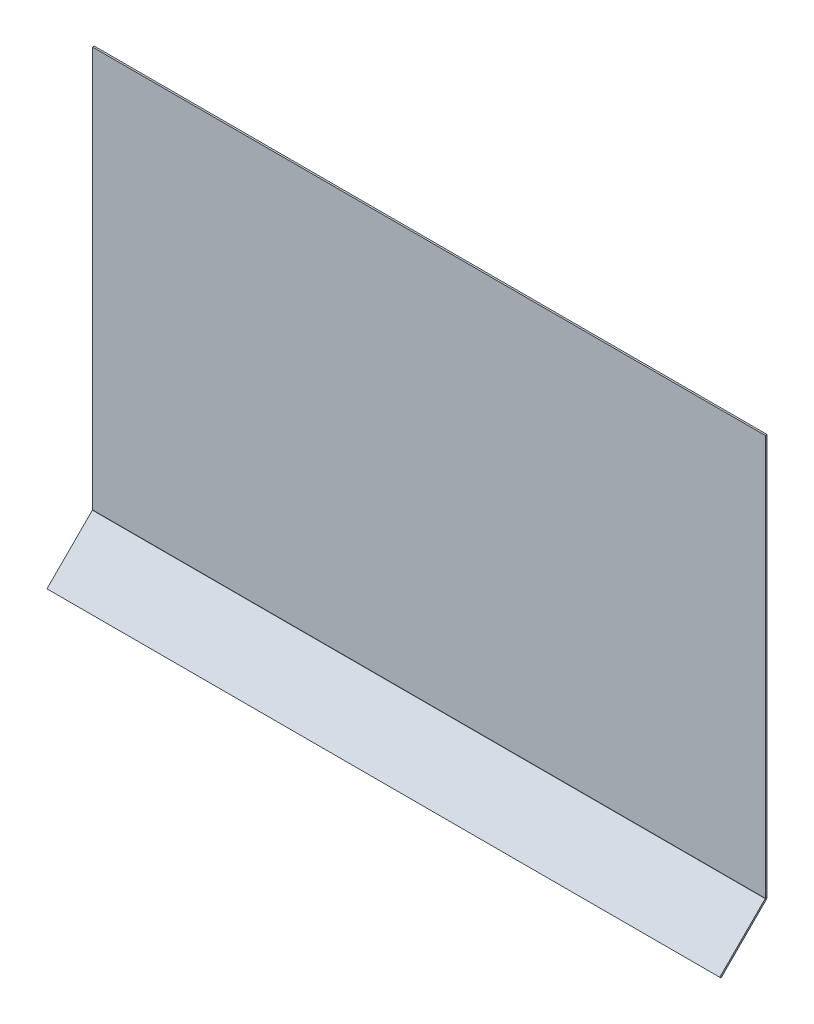
ISO-10303-21;
HEADER;
FILE_DESCRIPTION(('STEP AP214'),'2;1');
FILE_NAME('part.step','',(''),(''),'','','');
FILE_SCHEMA(('AUTOMOTIVE_DESIGN { 1 0 10303 214 1 1 1 1 }'));
ENDSEC;
DATA;
#1=APPLICATION_CONTEXT('core data for automotive mechanical design processes');
#2=APPLICATION_PROTOCOL_DEFINITION('international standard','automotive_design',2000,#1);
#3=PRODUCT_CONTEXT('',#1,'mechanical');
#4=PRODUCT('Part','Part','',(#3));
#5=PRODUCT_RELATED_PRODUCT_CATEGORY('part','',(#4));
#6=PRODUCT_DEFINITION_FORMATION('','',#4);
#7=PRODUCT_DEFINITION_CONTEXT('part definition',#1,'design');
#8=PRODUCT_DEFINITION('design','',#6,#7);
#9=PRODUCT_DEFINITION_SHAPE('','',#8);
#10=(LENGTH_UNIT() NAMED_UNIT(*) SI_UNIT(.MILLI.,.METRE.));
#11=(NAMED_UNIT(*) PLANE_ANGLE_UNIT() SI_UNIT($,.RADIAN.));
#12=(NAMED_UNIT(*) SI_UNIT($,.STERADIAN.) SOLID_ANGLE_UNIT());
#13=UNCERTAINTY_MEASURE_WITH_UNIT(LENGTH_MEASURE(1.E-05),#10,'distance_accuracy_value','');
#14=(GEOMETRIC_REPRESENTATION_CONTEXT(3) GLOBAL_UNCERTAINTY_ASSIGNED_CONTEXT((#13)) GLOBAL_UNIT_ASSIGNED_CONTEXT((#10,
#11,#12)) REPRESENTATION_CONTEXT('',''));
#15=CARTESIAN_POINT('',(0.,0.,0.));
#16=DIRECTION('',(0.,0.,1.));
#17=DIRECTION('',(1.,0.,0.));
#18=AXIS2_PLACEMENT_3D('',#15,#16,#17);
#19=CARTESIAN_POINT('',(-575.,-363.086855640565,-687.218254069481));
#20=DIRECTION('',(0.,-0.707106781186552,0.707106781186544));
#21=DIRECTION('',(1.,0.,0.));
#22=AXIS2_PLACEMENT_3D('',#19,#20,#21);
#23=PLANE('',#22);
#24=DIRECTION('',(0.,0.707106781186544,0.707106781186552));
#25=VECTOR('',#24,1.);
#26=CARTESIAN_POINT('',(-575.,-363.086855640565,-687.218254069481));
#27=LINE('',#26,#25);
#28=CARTESIAN_POINT('',(-575.,-365.208175984124,-689.33957441304));
#29=VERTEX_POINT('',#28);
#30=CARTESIAN_POINT('',(-575.,-363.086855640565,-687.218254069481));
#31=VERTEX_POINT('',#30);
#32=EDGE_CURVE('E11',#29,#31,#27,.T.);
#33=ORIENTED_EDGE('',*,*,#32,.F.);
#34=DIRECTION('',(1.,0.,0.));
#35=VECTOR('',#34,1.);
#36=CARTESIAN_POINT('',(-1.01821961997405E-13,-365.208175984124,-689.33957441304));
#37=LINE('',#36,#35);
#38=CARTESIAN_POINT('',(575.,-365.208175984124,-689.339574413041));
#39=VERTEX_POINT('',#38);
#40=EDGE_CURVE('E114',#39,#29,#37,.F.);
#41=ORIENTED_EDGE('',*,*,#40,.F.);
#42=DIRECTION('',(0.,0.707106781186544,0.707106781186552));
#43=VECTOR('',#42,1.);
#44=CARTESIAN_POINT('',(575.,-363.086855640565,-687.218254069481));
#45=LINE('',#44,#43);
#46=CARTESIAN_POINT('',(575.,-363.086855640565,-687.218254069481));
#47=VERTEX_POINT('',#46);
#48=EDGE_CURVE('E47',#39,#47,#45,.T.);
#49=ORIENTED_EDGE('',*,*,#48,.T.);
#50=DIRECTION('',(1.,0.,0.));
#51=VECTOR('',#50,1.);
#52=CARTESIAN_POINT('',(-575.,-363.086855640565,-687.218254069481));
#53=LINE('',#52,#51);
#54=EDGE_CURVE('E163',#47,#31,#53,.F.);
#55=ORIENTED_EDGE('',*,*,#54,.T.);
#56=EDGE_LOOP('',(#33,#41,#49,#55));
#57=FACE_BOUND('',#56,.T.);
#58=ADVANCED_FACE('F37',(#57),#23,.T.);
#59=CARTESIAN_POINT('',(575.,-363.086855640565,-687.218254069481));
#60=DIRECTION('',(1.,0.,0.));
#61=DIRECTION('',(0.,0.707106781186552,-0.707106781186544));
#62=AXIS2_PLACEMENT_3D('',#59,#60,#61);
#63=PLANE('',#62);
#64=ORIENTED_EDGE('',*,*,#48,.F.);
#65=DIRECTION('',(0.,-0.707106781186552,0.707106781186544));
#66=VECTOR('',#65,1.);
#67=CARTESIAN_POINT('',(575.,-527.426430053602,-527.121320343564));
#68=LINE('',#67,#66);
#69=CARTESIAN_POINT('',(575.,-287.642175198582,-766.905575198582));
#70=VERTEX_POINT('',#69);
#71=EDGE_CURVE('E111',#70,#39,#68,.T.);
#72=ORIENTED_EDGE('',*,*,#71,.F.);
#73=DIRECTION('',(0.,0.70710678118651,0.707106781186585));
#74=VECTOR('',#73,1.);
#75=CARTESIAN_POINT('',(575.,-285.520854855022,-764.784254855023));
#76=LINE('',#75,#74);
#77=CARTESIAN_POINT('',(575.,-285.520854855022,-764.784254855023));
#78=VERTEX_POINT('',#77);
#79=EDGE_CURVE('E146',#70,#78,#76,.T.);
#80=ORIENTED_EDGE('',*,*,#79,.T.);
#81=DIRECTION('',(0.,0.707106781186552,-0.707106781186544));
#82=VECTOR('',#81,1.);
#83=CARTESIAN_POINT('',(575.,-363.086855640565,-687.218254069481));
#84=LINE('',#83,#82);
#85=EDGE_CURVE('E154',#78,#47,#84,.F.);
#86=ORIENTED_EDGE('',*,*,#85,.T.);
#87=EDGE_LOOP('',(#64,#72,#80,#86));
#88=FACE_BOUND('',#87,.T.);
#89=ADVANCED_FACE('F153',(#88),#63,.T.);
#90=CARTESIAN_POINT('',(575.,-285.,-764.263400000001));
#91=DIRECTION('',(-1.,0.,0.));
#92=DIRECTION('',(0.,0.,1.));
#93=AXIS2_PLACEMENT_3D('',#90,#91,#92);
#94=PLANE('',#93);
#95=ORIENTED_EDGE('',*,*,#79,.F.);
#96=CARTESIAN_POINT('',(575.,-285.,-764.263400000001));
#97=DIRECTION('',(1.,0.,0.));
#98=DIRECTION('',(0.,0.,-1.));
#99=AXIS2_PLACEMENT_3D('',#96,#97,#98);
#100=CIRCLE('',#99,3.7366);
#101=CARTESIAN_POINT('',(575.,-285.,-768.));
#102=VERTEX_POINT('',#101);
#103=EDGE_CURVE('E107',#70,#102,#100,.T.);
#104=ORIENTED_EDGE('',*,*,#103,.T.);
#105=DIRECTION('',(0.,0.,1.));
#106=VECTOR('',#105,1.);
#107=CARTESIAN_POINT('',(575.,-285.,-765.));
#108=LINE('',#107,#106);
#109=CARTESIAN_POINT('',(575.,-285.,-765.));
#110=VERTEX_POINT('',#109);
#111=EDGE_CURVE('E143',#102,#110,#108,.T.);
#112=ORIENTED_EDGE('',*,*,#111,.T.);
#113=CARTESIAN_POINT('',(575.,-285.,-764.263400000001));
#114=DIRECTION('',(1.,0.,0.));
#115=DIRECTION('',(0.,0.,-1.));
#116=AXIS2_PLACEMENT_3D('',#113,#114,#115);
#117=CIRCLE('',#116,0.736600000000002);
#118=EDGE_CURVE('E96',#78,#110,#117,.T.);
#119=ORIENTED_EDGE('',*,*,#118,.F.);
#120=EDGE_LOOP('',(#95,#104,#112,#119));
#121=FACE_BOUND('',#120,.T.);
#122=ADVANCED_FACE('F167',(#121),#94,.F.);
#123=CARTESIAN_POINT('',(575.,400.,-765.));
#124=DIRECTION('',(1.,0.,0.));
#125=DIRECTION('',(0.,-1.,0.));
#126=AXIS2_PLACEMENT_3D('',#123,#124,#125);
#127=PLANE('',#126);
#128=ORIENTED_EDGE('',*,*,#111,.F.);
#129=DIRECTION('',(0.,1.,0.));
#130=VECTOR('',#129,1.);
#131=CARTESIAN_POINT('',(575.,2.11801214624424E-13,-768.));
#132=LINE('',#131,#130);
#133=CARTESIAN_POINT('',(575.,400.,-768.));
#134=VERTEX_POINT('',#133);
#135=EDGE_CURVE('E132',#134,#102,#132,.F.);
#136=ORIENTED_EDGE('',*,*,#135,.F.);
#137=DIRECTION('',(0.,0.,1.));
#138=VECTOR('',#137,1.);
#139=CARTESIAN_POINT('',(575.,400.,-765.));
#140=LINE('',#139,#138);
#141=CARTESIAN_POINT('',(575.,400.,-765.));
#142=VERTEX_POINT('',#141);
#143=EDGE_CURVE('E140',#134,#142,#140,.T.);
#144=ORIENTED_EDGE('',*,*,#143,.T.);
#145=DIRECTION('',(0.,-1.,0.));
#146=VECTOR('',#145,1.);
#147=CARTESIAN_POINT('',(575.,400.,-765.));
#148=LINE('',#147,#146);
#149=EDGE_CURVE('E189',#142,#110,#148,.T.);
#150=ORIENTED_EDGE('',*,*,#149,.T.);
#151=EDGE_LOOP('',(#128,#136,#144,#150));
#152=FACE_BOUND('',#151,.T.);
#153=ADVANCED_FACE('F186',(#152),#127,.T.);
#154=CARTESIAN_POINT('',(575.,400.,-765.));
#155=DIRECTION('',(0.,1.,0.));
#156=DIRECTION('',(1.,0.,0.));
#157=AXIS2_PLACEMENT_3D('',#154,#155,#156);
#158=PLANE('',#157);
#159=ORIENTED_EDGE('',*,*,#143,.F.);
#160=DIRECTION('',(1.,0.,0.));
#161=VECTOR('',#160,1.);
#162=CARTESIAN_POINT('',(0.,400.,-768.));
#163=LINE('',#162,#161);
#164=CARTESIAN_POINT('',(-575.,400.,-768.));
#165=VERTEX_POINT('',#164);
#166=EDGE_CURVE('E129',#165,#134,#163,.T.);
#167=ORIENTED_EDGE('',*,*,#166,.F.);
#168=DIRECTION('',(0.,0.,1.));
#169=VECTOR('',#168,1.);
#170=CARTESIAN_POINT('',(-575.,400.,-765.));
#171=LINE('',#170,#169);
#172=CARTESIAN_POINT('',(-575.,400.,-765.));
#173=VERTEX_POINT('',#172);
#174=EDGE_CURVE('E137',#165,#173,#171,.T.);
#175=ORIENTED_EDGE('',*,*,#174,.T.);
#176=DIRECTION('',(1.,0.,0.));
#177=VECTOR('',#176,1.);
#178=CARTESIAN_POINT('',(575.,400.,-765.));
#179=LINE('',#178,#177);
#180=EDGE_CURVE('E164',#173,#142,#179,.T.);
#181=ORIENTED_EDGE('',*,*,#180,.T.);
#182=EDGE_LOOP('',(#159,#167,#175,#181));
#183=FACE_BOUND('',#182,.T.);
#184=ADVANCED_FACE('F207',(#183),#158,.T.);
#185=CARTESIAN_POINT('',(-575.,400.,-765.));
#186=DIRECTION('',(-1.,0.,0.));
#187=DIRECTION('',(0.,1.,0.));
#188=AXIS2_PLACEMENT_3D('',#185,#186,#187);
#189=PLANE('',#188);
#190=ORIENTED_EDGE('',*,*,#174,.F.);
#191=DIRECTION('',(0.,1.,0.));
#192=VECTOR('',#191,1.);
#193=CARTESIAN_POINT('',(-575.,2.11801214624424E-13,-768.));
#194=LINE('',#193,#192);
#195=CARTESIAN_POINT('',(-575.,-285.,-768.));
#196=VERTEX_POINT('',#195);
#197=EDGE_CURVE('E125',#196,#165,#194,.T.);
#198=ORIENTED_EDGE('',*,*,#197,.F.);
#199=DIRECTION('',(6.02890591705327E-13,-1.50722647926332E-13,1.));
#200=VECTOR('',#199,1.);
#201=CARTESIAN_POINT('',(-575.,-285.,-765.));
#202=LINE('',#201,#200);
#203=CARTESIAN_POINT('',(-575.,-285.,-765.));
#204=VERTEX_POINT('',#203);
#205=EDGE_CURVE('E95',#196,#204,#202,.T.);
#206=ORIENTED_EDGE('',*,*,#205,.T.);
#207=DIRECTION('',(0.,1.,0.));
#208=VECTOR('',#207,1.);
#209=CARTESIAN_POINT('',(-575.,400.,-765.));
#210=LINE('',#209,#208);
#211=EDGE_CURVE('E120',#204,#173,#210,.T.);
#212=ORIENTED_EDGE('',*,*,#211,.T.);
#213=EDGE_LOOP('',(#190,#198,#206,#212));
#214=FACE_BOUND('',#213,.T.);
#215=ADVANCED_FACE('F201',(#214),#189,.T.);
#216=CARTESIAN_POINT('',(-575.,-285.,-764.263400000001));
#217=DIRECTION('',(-1.,0.,0.));
#218=DIRECTION('',(0.,0.,1.));
#219=AXIS2_PLACEMENT_3D('',#216,#217,#218);
#220=PLANE('',#219);
#221=ORIENTED_EDGE('',*,*,#205,.F.);
#222=CARTESIAN_POINT('',(-575.,-285.,-764.263400000001));
#223=DIRECTION('',(1.,0.,0.));
#224=DIRECTION('',(0.,0.,-1.));
#225=AXIS2_PLACEMENT_3D('',#222,#223,#224);
#226=CIRCLE('',#225,3.7366);
#227=CARTESIAN_POINT('',(-575.,-287.642175198581,-766.905575198582));
#228=VERTEX_POINT('',#227);
#229=EDGE_CURVE('E104',#196,#228,#226,.F.);
#230=ORIENTED_EDGE('',*,*,#229,.T.);
#231=DIRECTION('',(0.,0.707106781186544,0.707106781186552));
#232=VECTOR('',#231,1.);
#233=CARTESIAN_POINT('',(-574.999999999999,-285.520854855022,-764.784254855023));
#234=LINE('',#233,#232);
#235=CARTESIAN_POINT('',(-574.999999999999,-285.520854855022,-764.784254855023));
#236=VERTEX_POINT('',#235);
#237=EDGE_CURVE('E41',#228,#236,#234,.T.);
#238=ORIENTED_EDGE('',*,*,#237,.T.);
#239=CARTESIAN_POINT('',(-575.,-285.,-764.263400000001));
#240=DIRECTION('',(1.,0.,0.));
#241=DIRECTION('',(0.,0.,-1.));
#242=AXIS2_PLACEMENT_3D('',#239,#240,#241);
#243=CIRCLE('',#242,0.736600000000002);
#244=EDGE_CURVE('E173',#204,#236,#243,.F.);
#245=ORIENTED_EDGE('',*,*,#244,.F.);
#246=EDGE_LOOP('',(#221,#230,#238,#245));
#247=FACE_BOUND('',#246,.T.);
#248=ADVANCED_FACE('F116',(#247),#220,.T.);
#249=CARTESIAN_POINT('',(-575.,-285.305109710044,-765.000000000001));
#250=DIRECTION('',(-1.,0.,0.));
#251=DIRECTION('',(0.,-0.707106781186552,0.707106781186544));
#252=AXIS2_PLACEMENT_3D('',#249,#250,#251);
#253=PLANE('',#252);
#254=DIRECTION('',(0.,-0.707106781186552,0.707106781186544));
#255=VECTOR('',#254,1.);
#256=CARTESIAN_POINT('',(-575.,-527.426430053602,-527.121320343564));
#257=LINE('',#256,#255);
#258=EDGE_CURVE('E87',#29,#228,#257,.F.);
#259=ORIENTED_EDGE('',*,*,#258,.F.);
#260=ORIENTED_EDGE('',*,*,#32,.T.);
#261=DIRECTION('',(0.,-0.707106781186552,0.707106781186544));
#262=VECTOR('',#261,1.);
#263=CARTESIAN_POINT('',(-575.,-285.305109710044,-765.000000000001));
#264=LINE('',#263,#262);
#265=EDGE_CURVE('E89',#31,#236,#264,.F.);
#266=ORIENTED_EDGE('',*,*,#265,.T.);
#267=ORIENTED_EDGE('',*,*,#237,.F.);
#268=EDGE_LOOP('',(#259,#260,#266,#267));
#269=FACE_BOUND('',#268,.T.);
#270=ADVANCED_FACE('F39',(#269),#253,.T.);
#271=CARTESIAN_POINT('',(575.,-285.,-764.263400000001));
#272=DIRECTION('',(1.,0.,0.));
#273=DIRECTION('',(0.,-0.707106781186543,-0.707106781186552));
#274=AXIS2_PLACEMENT_3D('',#271,#272,#273);
#275=CYLINDRICAL_SURFACE('',#274,0.736600000000002);
#276=DIRECTION('',(-1.,0.,0.));
#277=VECTOR('',#276,1.);
#278=CARTESIAN_POINT('',(575.,-285.,-765.));
#279=LINE('',#278,#277);
#280=EDGE_CURVE('E194',#110,#204,#279,.T.);
#281=ORIENTED_EDGE('',*,*,#280,.T.);
#282=ORIENTED_EDGE('',*,*,#244,.T.);
#283=DIRECTION('',(1.,0.,0.));
#284=VECTOR('',#283,1.);
#285=CARTESIAN_POINT('',(-575.,-285.520854855022,-764.784254855022));
#286=LINE('',#285,#284);
#287=EDGE_CURVE('E162',#236,#78,#286,.T.);
#288=ORIENTED_EDGE('',*,*,#287,.T.);
#289=ORIENTED_EDGE('',*,*,#118,.T.);
#290=EDGE_LOOP('',(#281,#282,#288,#289));
#291=FACE_BOUND('',#290,.T.);
#292=ADVANCED_FACE('F175',(#291),#275,.F.);
#293=CARTESIAN_POINT('',(-1.01412372660357E-13,-525.305109710043,-525.000000000005));
#294=DIRECTION('',(0.,0.707106781186544,0.707106781186552));
#295=DIRECTION('',(0.,-0.707106781186552,0.707106781186544));
#296=AXIS2_PLACEMENT_3D('',#293,#294,#295);
#297=PLANE('',#296);
#298=ORIENTED_EDGE('',*,*,#85,.F.);
#299=ORIENTED_EDGE('',*,*,#287,.F.);
#300=ORIENTED_EDGE('',*,*,#265,.F.);
#301=ORIENTED_EDGE('',*,*,#54,.F.);
#302=EDGE_LOOP('',(#298,#299,#300,#301));
#303=FACE_BOUND('',#302,.T.);
#304=ADVANCED_FACE('F160',(#303),#297,.T.);
#305=CARTESIAN_POINT('',(0.,2.10973719202344E-13,-765.));
#306=DIRECTION('',(0.,0.,-1.));
#307=DIRECTION('',(0.,1.,0.));
#308=AXIS2_PLACEMENT_3D('',#305,#306,#307);
#309=PLANE('',#308);
#310=ORIENTED_EDGE('',*,*,#211,.F.);
#311=ORIENTED_EDGE('',*,*,#280,.F.);
#312=ORIENTED_EDGE('',*,*,#149,.F.);
#313=ORIENTED_EDGE('',*,*,#180,.F.);
#314=EDGE_LOOP('',(#310,#311,#312,#313));
#315=FACE_BOUND('',#314,.T.);
#316=ADVANCED_FACE('F203',(#315),#309,.F.);
#317=CARTESIAN_POINT('',(575.,-285.,-764.263400000001));
#318=DIRECTION('',(1.,0.,0.));
#319=DIRECTION('',(0.,-0.707106781186543,-0.707106781186552));
#320=AXIS2_PLACEMENT_3D('',#317,#318,#319);
#321=CYLINDRICAL_SURFACE('',#320,3.7366);
#322=DIRECTION('',(1.,0.,0.));
#323=VECTOR('',#322,1.);
#324=CARTESIAN_POINT('',(575.,-285.,-768.));
#325=LINE('',#324,#323);
#326=EDGE_CURVE('E128',#102,#196,#325,.F.);
#327=ORIENTED_EDGE('',*,*,#326,.F.);
#328=ORIENTED_EDGE('',*,*,#103,.F.);
#329=DIRECTION('',(1.,0.,0.));
#330=VECTOR('',#329,1.);
#331=CARTESIAN_POINT('',(575.,-287.642175198581,-766.905575198582));
#332=LINE('',#331,#330);
#333=EDGE_CURVE('E101',#228,#70,#332,.T.);
#334=ORIENTED_EDGE('',*,*,#333,.F.);
#335=ORIENTED_EDGE('',*,*,#229,.F.);
#336=EDGE_LOOP('',(#327,#328,#334,#335));
#337=FACE_BOUND('',#336,.T.);
#338=ADVANCED_FACE('F103',(#337),#321,.T.);
#339=CARTESIAN_POINT('',(-1.01821961997405E-13,-527.426430053602,-527.121320343564));
#340=DIRECTION('',(0.,0.707106781186544,0.707106781186552));
#341=DIRECTION('',(0.,-0.707106781186552,0.707106781186544));
#342=AXIS2_PLACEMENT_3D('',#339,#340,#341);
#343=PLANE('',#342);
#344=ORIENTED_EDGE('',*,*,#71,.T.);
#345=ORIENTED_EDGE('',*,*,#40,.T.);
#346=ORIENTED_EDGE('',*,*,#258,.T.);
#347=ORIENTED_EDGE('',*,*,#333,.T.);
#348=EDGE_LOOP('',(#344,#345,#346,#347));
#349=FACE_BOUND('',#348,.T.);
#350=ADVANCED_FACE('F113',(#349),#343,.F.);
#351=CARTESIAN_POINT('',(0.,2.11801214624424E-13,-768.));
#352=DIRECTION('',(0.,0.,-1.));
#353=DIRECTION('',(0.,1.,0.));
#354=AXIS2_PLACEMENT_3D('',#351,#352,#353);
#355=PLANE('',#354);
#356=ORIENTED_EDGE('',*,*,#197,.T.);
#357=ORIENTED_EDGE('',*,*,#166,.T.);
#358=ORIENTED_EDGE('',*,*,#135,.T.);
#359=ORIENTED_EDGE('',*,*,#326,.T.);
#360=EDGE_LOOP('',(#356,#357,#358,#359));
#361=FACE_BOUND('',#360,.T.);
#362=ADVANCED_FACE('F182',(#361),#355,.T.);
#363=CLOSED_SHELL('',(#58,#89,#122,#153,#184,#215,#248,#270,#292,#304,#316,#338,#350,#362));
#364=MANIFOLD_SOLID_BREP('B2',#363);
#365=ADVANCED_BREP_SHAPE_REPRESENTATION('',(#18,#364),#14);
#366=SHAPE_DEFINITION_REPRESENTATION(#9,#365);
ENDSEC;
END-ISO-10303-21;
